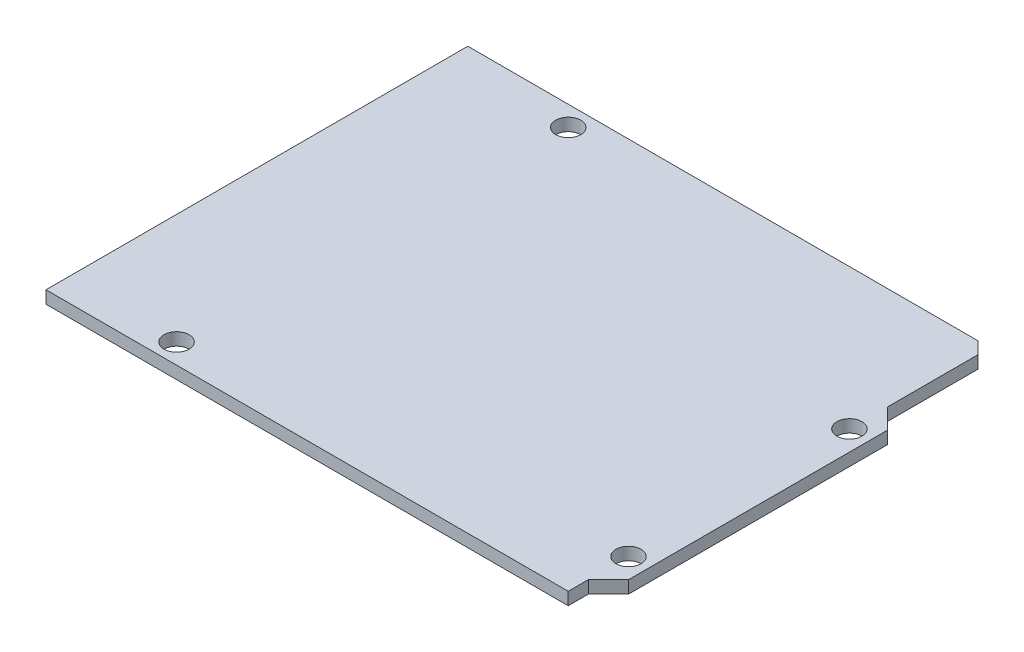
ISO-10303-21;
HEADER;
FILE_DESCRIPTION(('STEP AP214'),'2;1');
FILE_NAME('part.step','',(''),(''),'','','');
FILE_SCHEMA(('AUTOMOTIVE_DESIGN { 1 0 10303 214 1 1 1 1 }'));
ENDSEC;
DATA;
#1=APPLICATION_CONTEXT('core data for automotive mechanical design processes');
#2=APPLICATION_PROTOCOL_DEFINITION('international standard','automotive_design',2000,#1);
#3=PRODUCT_CONTEXT('',#1,'mechanical');
#4=PRODUCT('Part','Part','',(#3));
#5=PRODUCT_RELATED_PRODUCT_CATEGORY('part','',(#4));
#6=PRODUCT_DEFINITION_FORMATION('','',#4);
#7=PRODUCT_DEFINITION_CONTEXT('part definition',#1,'design');
#8=PRODUCT_DEFINITION('design','',#6,#7);
#9=PRODUCT_DEFINITION_SHAPE('','',#8);
#10=(LENGTH_UNIT() NAMED_UNIT(*) SI_UNIT(.MILLI.,.METRE.));
#11=(NAMED_UNIT(*) PLANE_ANGLE_UNIT() SI_UNIT($,.RADIAN.));
#12=(NAMED_UNIT(*) SI_UNIT($,.STERADIAN.) SOLID_ANGLE_UNIT());
#13=UNCERTAINTY_MEASURE_WITH_UNIT(LENGTH_MEASURE(1.E-05),#10,'distance_accuracy_value','');
#14=(GEOMETRIC_REPRESENTATION_CONTEXT(3) GLOBAL_UNCERTAINTY_ASSIGNED_CONTEXT((#13)) GLOBAL_UNIT_ASSIGNED_CONTEXT((#10,
#11,#12)) REPRESENTATION_CONTEXT('',''));
#15=CARTESIAN_POINT('',(0.,0.,0.));
#16=DIRECTION('',(0.,0.,1.));
#17=DIRECTION('',(1.,0.,0.));
#18=AXIS2_PLACEMENT_3D('',#15,#16,#17);
#19=CARTESIAN_POINT('',(66.04,1.5875,0.));
#20=DIRECTION('',(0.,0.,-1.));
#21=DIRECTION('',(-1.,0.,0.));
#22=AXIS2_PLACEMENT_3D('',#19,#20,#21);
#23=PLANE('',#22);
#24=DIRECTION('',(1.,0.,0.));
#25=VECTOR('',#24,1.);
#26=CARTESIAN_POINT('',(66.04,0.,0.));
#27=LINE('',#26,#25);
#28=CARTESIAN_POINT('',(0.,0.,0.));
#29=VERTEX_POINT('',#28);
#30=CARTESIAN_POINT('',(66.04,0.,0.));
#31=VERTEX_POINT('',#30);
#32=EDGE_CURVE('E139',#29,#31,#27,.T.);
#33=ORIENTED_EDGE('',*,*,#32,.T.);
#34=DIRECTION('',(0.,-1.,0.));
#35=VECTOR('',#34,1.);
#36=CARTESIAN_POINT('',(66.04,1.5875,0.));
#37=LINE('',#36,#35);
#38=CARTESIAN_POINT('',(66.04,1.5875,0.));
#39=VERTEX_POINT('',#38);
#40=EDGE_CURVE('E11',#39,#31,#37,.T.);
#41=ORIENTED_EDGE('',*,*,#40,.F.);
#42=DIRECTION('',(1.,0.,0.));
#43=VECTOR('',#42,1.);
#44=CARTESIAN_POINT('',(66.04,1.5875,0.));
#45=LINE('',#44,#43);
#46=CARTESIAN_POINT('',(0.,1.5875,0.));
#47=VERTEX_POINT('',#46);
#48=EDGE_CURVE('E156',#47,#39,#45,.T.);
#49=ORIENTED_EDGE('',*,*,#48,.F.);
#50=DIRECTION('',(0.,-1.,0.));
#51=VECTOR('',#50,1.);
#52=CARTESIAN_POINT('',(0.,1.5875,0.));
#53=LINE('',#52,#51);
#54=EDGE_CURVE('E135',#47,#29,#53,.T.);
#55=ORIENTED_EDGE('',*,*,#54,.T.);
#56=EDGE_LOOP('',(#33,#41,#49,#55));
#57=FACE_BOUND('',#56,.T.);
#58=ADVANCED_FACE('F37',(#57),#23,.F.);
#59=CARTESIAN_POINT('',(66.04,1.5875,-2.54));
#60=DIRECTION('',(-1.,0.,0.));
#61=DIRECTION('',(0.,0.,1.));
#62=AXIS2_PLACEMENT_3D('',#59,#60,#61);
#63=PLANE('',#62);
#64=DIRECTION('',(0.,0.,-1.));
#65=VECTOR('',#64,1.);
#66=CARTESIAN_POINT('',(66.04,0.,-2.54));
#67=LINE('',#66,#65);
#68=CARTESIAN_POINT('',(66.04,0.,-2.54));
#69=VERTEX_POINT('',#68);
#70=EDGE_CURVE('E142',#31,#69,#67,.T.);
#71=ORIENTED_EDGE('',*,*,#70,.T.);
#72=DIRECTION('',(0.,-1.,0.));
#73=VECTOR('',#72,1.);
#74=CARTESIAN_POINT('',(66.04,1.5875,-2.54));
#75=LINE('',#74,#73);
#76=CARTESIAN_POINT('',(66.04,1.5875,-2.54));
#77=VERTEX_POINT('',#76);
#78=EDGE_CURVE('E45',#77,#69,#75,.T.);
#79=ORIENTED_EDGE('',*,*,#78,.F.);
#80=DIRECTION('',(0.,0.,-1.));
#81=VECTOR('',#80,1.);
#82=CARTESIAN_POINT('',(66.04,1.5875,-2.54));
#83=LINE('',#82,#81);
#84=EDGE_CURVE('E99',#39,#77,#83,.T.);
#85=ORIENTED_EDGE('',*,*,#84,.F.);
#86=ORIENTED_EDGE('',*,*,#40,.T.);
#87=EDGE_LOOP('',(#71,#79,#85,#86));
#88=FACE_BOUND('',#87,.T.);
#89=ADVANCED_FACE('F249',(#88),#63,.F.);
#90=CARTESIAN_POINT('',(68.58,1.5875,-5.08));
#91=DIRECTION('',(-0.707106781186547,0.,-0.707106781186548));
#92=DIRECTION('',(-0.707106781186548,0.,0.707106781186547));
#93=AXIS2_PLACEMENT_3D('',#90,#91,#92);
#94=PLANE('',#93);
#95=DIRECTION('',(0.707106781186548,0.,-0.707106781186547));
#96=VECTOR('',#95,1.);
#97=CARTESIAN_POINT('',(68.58,0.,-5.08));
#98=LINE('',#97,#96);
#99=CARTESIAN_POINT('',(68.58,0.,-5.08));
#100=VERTEX_POINT('',#99);
#101=EDGE_CURVE('E145',#69,#100,#98,.T.);
#102=ORIENTED_EDGE('',*,*,#101,.T.);
#103=DIRECTION('',(0.,-1.,0.));
#104=VECTOR('',#103,1.);
#105=CARTESIAN_POINT('',(68.58,1.5875,-5.08));
#106=LINE('',#105,#104);
#107=CARTESIAN_POINT('',(68.58,1.5875,-5.08));
#108=VERTEX_POINT('',#107);
#109=EDGE_CURVE('E166',#108,#100,#106,.T.);
#110=ORIENTED_EDGE('',*,*,#109,.F.);
#111=DIRECTION('',(0.707106781186548,0.,-0.707106781186547));
#112=VECTOR('',#111,1.);
#113=CARTESIAN_POINT('',(68.58,1.5875,-5.08));
#114=LINE('',#113,#112);
#115=EDGE_CURVE('E174',#77,#108,#114,.T.);
#116=ORIENTED_EDGE('',*,*,#115,.F.);
#117=ORIENTED_EDGE('',*,*,#78,.T.);
#118=EDGE_LOOP('',(#102,#110,#116,#117));
#119=FACE_BOUND('',#118,.T.);
#120=ADVANCED_FACE('F172',(#119),#94,.F.);
#121=CARTESIAN_POINT('',(68.58,1.5875,-37.846));
#122=DIRECTION('',(-1.,0.,0.));
#123=DIRECTION('',(0.,0.,1.));
#124=AXIS2_PLACEMENT_3D('',#121,#122,#123);
#125=PLANE('',#124);
#126=DIRECTION('',(0.,0.,-1.));
#127=VECTOR('',#126,1.);
#128=CARTESIAN_POINT('',(68.58,0.,-37.846));
#129=LINE('',#128,#127);
#130=CARTESIAN_POINT('',(68.58,0.,-37.846));
#131=VERTEX_POINT('',#130);
#132=EDGE_CURVE('E147',#100,#131,#129,.T.);
#133=ORIENTED_EDGE('',*,*,#132,.T.);
#134=DIRECTION('',(0.,-1.,0.));
#135=VECTOR('',#134,1.);
#136=CARTESIAN_POINT('',(68.58,1.5875,-37.846));
#137=LINE('',#136,#135);
#138=CARTESIAN_POINT('',(68.58,1.5875,-37.846));
#139=VERTEX_POINT('',#138);
#140=EDGE_CURVE('E163',#139,#131,#137,.T.);
#141=ORIENTED_EDGE('',*,*,#140,.F.);
#142=DIRECTION('',(0.,0.,-1.));
#143=VECTOR('',#142,1.);
#144=CARTESIAN_POINT('',(68.58,1.5875,-37.846));
#145=LINE('',#144,#143);
#146=EDGE_CURVE('E190',#108,#139,#145,.T.);
#147=ORIENTED_EDGE('',*,*,#146,.F.);
#148=ORIENTED_EDGE('',*,*,#109,.T.);
#149=EDGE_LOOP('',(#133,#141,#147,#148));
#150=FACE_BOUND('',#149,.T.);
#151=ADVANCED_FACE('F183',(#150),#125,.F.);
#152=CARTESIAN_POINT('',(66.04,1.5875,-40.386));
#153=DIRECTION('',(-0.707106781186548,0.,0.707106781186548));
#154=DIRECTION('',(0.707106781186548,0.,0.707106781186548));
#155=AXIS2_PLACEMENT_3D('',#152,#153,#154);
#156=PLANE('',#155);
#157=DIRECTION('',(-0.707106781186548,0.,-0.707106781186548));
#158=VECTOR('',#157,1.);
#159=CARTESIAN_POINT('',(66.04,0.,-40.386));
#160=LINE('',#159,#158);
#161=CARTESIAN_POINT('',(66.04,0.,-40.386));
#162=VERTEX_POINT('',#161);
#163=EDGE_CURVE('E149',#131,#162,#160,.T.);
#164=ORIENTED_EDGE('',*,*,#163,.T.);
#165=DIRECTION('',(0.,-1.,0.));
#166=VECTOR('',#165,1.);
#167=CARTESIAN_POINT('',(66.04,1.5875,-40.386));
#168=LINE('',#167,#166);
#169=CARTESIAN_POINT('',(66.04,1.5875,-40.386));
#170=VERTEX_POINT('',#169);
#171=EDGE_CURVE('E160',#170,#162,#168,.T.);
#172=ORIENTED_EDGE('',*,*,#171,.F.);
#173=DIRECTION('',(-0.707106781186548,0.,-0.707106781186548));
#174=VECTOR('',#173,1.);
#175=CARTESIAN_POINT('',(66.04,1.5875,-40.386));
#176=LINE('',#175,#174);
#177=EDGE_CURVE('E189',#139,#170,#176,.T.);
#178=ORIENTED_EDGE('',*,*,#177,.F.);
#179=ORIENTED_EDGE('',*,*,#140,.T.);
#180=EDGE_LOOP('',(#164,#172,#178,#179));
#181=FACE_BOUND('',#180,.T.);
#182=ADVANCED_FACE('F187',(#181),#156,.F.);
#183=CARTESIAN_POINT('',(66.04,1.5875,-51.816));
#184=DIRECTION('',(-1.,0.,0.));
#185=DIRECTION('',(0.,0.,1.));
#186=AXIS2_PLACEMENT_3D('',#183,#184,#185);
#187=PLANE('',#186);
#188=DIRECTION('',(0.,0.,-1.));
#189=VECTOR('',#188,1.);
#190=CARTESIAN_POINT('',(66.04,0.,-51.816));
#191=LINE('',#190,#189);
#192=CARTESIAN_POINT('',(66.04,0.,-51.816));
#193=VERTEX_POINT('',#192);
#194=EDGE_CURVE('E151',#162,#193,#191,.T.);
#195=ORIENTED_EDGE('',*,*,#194,.T.);
#196=DIRECTION('',(0.,-1.,0.));
#197=VECTOR('',#196,1.);
#198=CARTESIAN_POINT('',(66.04,1.5875,-51.816));
#199=LINE('',#198,#197);
#200=CARTESIAN_POINT('',(66.04,1.5875,-51.816));
#201=VERTEX_POINT('',#200);
#202=EDGE_CURVE('E130',#201,#193,#199,.T.);
#203=ORIENTED_EDGE('',*,*,#202,.F.);
#204=DIRECTION('',(0.,0.,-1.));
#205=VECTOR('',#204,1.);
#206=CARTESIAN_POINT('',(66.04,1.5875,-51.816));
#207=LINE('',#206,#205);
#208=EDGE_CURVE('E121',#170,#201,#207,.T.);
#209=ORIENTED_EDGE('',*,*,#208,.F.);
#210=ORIENTED_EDGE('',*,*,#171,.T.);
#211=EDGE_LOOP('',(#195,#203,#209,#210));
#212=FACE_BOUND('',#211,.T.);
#213=ADVANCED_FACE('F257',(#212),#187,.F.);
#214=CARTESIAN_POINT('',(64.516,1.5875,-53.34));
#215=DIRECTION('',(-0.707106781186548,0.,0.707106781186548));
#216=DIRECTION('',(0.707106781186548,0.,0.707106781186548));
#217=AXIS2_PLACEMENT_3D('',#214,#215,#216);
#218=PLANE('',#217);
#219=DIRECTION('',(-0.707106781186548,0.,-0.707106781186548));
#220=VECTOR('',#219,1.);
#221=CARTESIAN_POINT('',(64.516,0.,-53.34));
#222=LINE('',#221,#220);
#223=CARTESIAN_POINT('',(64.516,0.,-53.34));
#224=VERTEX_POINT('',#223);
#225=EDGE_CURVE('E129',#193,#224,#222,.T.);
#226=ORIENTED_EDGE('',*,*,#225,.T.);
#227=DIRECTION('',(0.,-1.,0.));
#228=VECTOR('',#227,1.);
#229=CARTESIAN_POINT('',(64.516,1.5875,-53.34));
#230=LINE('',#229,#228);
#231=CARTESIAN_POINT('',(64.516,1.5875,-53.34));
#232=VERTEX_POINT('',#231);
#233=EDGE_CURVE('E126',#232,#224,#230,.T.);
#234=ORIENTED_EDGE('',*,*,#233,.F.);
#235=DIRECTION('',(-0.707106781186548,0.,-0.707106781186548));
#236=VECTOR('',#235,1.);
#237=CARTESIAN_POINT('',(64.516,1.5875,-53.34));
#238=LINE('',#237,#236);
#239=EDGE_CURVE('E115',#201,#232,#238,.T.);
#240=ORIENTED_EDGE('',*,*,#239,.F.);
#241=ORIENTED_EDGE('',*,*,#202,.T.);
#242=EDGE_LOOP('',(#226,#234,#240,#241));
#243=FACE_BOUND('',#242,.T.);
#244=ADVANCED_FACE('F127',(#243),#218,.F.);
#245=CARTESIAN_POINT('',(0.,1.5875,-53.34));
#246=DIRECTION('',(0.,0.,1.));
#247=DIRECTION('',(1.,0.,0.));
#248=AXIS2_PLACEMENT_3D('',#245,#246,#247);
#249=PLANE('',#248);
#250=DIRECTION('',(-1.,0.,0.));
#251=VECTOR('',#250,1.);
#252=CARTESIAN_POINT('',(0.,0.,-53.34));
#253=LINE('',#252,#251);
#254=CARTESIAN_POINT('',(0.,0.,-53.34));
#255=VERTEX_POINT('',#254);
#256=EDGE_CURVE('E85',#224,#255,#253,.T.);
#257=ORIENTED_EDGE('',*,*,#256,.T.);
#258=DIRECTION('',(0.,-1.,0.));
#259=VECTOR('',#258,1.);
#260=CARTESIAN_POINT('',(0.,1.5875,-53.34));
#261=LINE('',#260,#259);
#262=CARTESIAN_POINT('',(0.,1.5875,-53.34));
#263=VERTEX_POINT('',#262);
#264=EDGE_CURVE('E131',#263,#255,#261,.T.);
#265=ORIENTED_EDGE('',*,*,#264,.F.);
#266=DIRECTION('',(-1.,0.,0.));
#267=VECTOR('',#266,1.);
#268=CARTESIAN_POINT('',(0.,1.5875,-53.34));
#269=LINE('',#268,#267);
#270=EDGE_CURVE('E119',#232,#263,#269,.T.);
#271=ORIENTED_EDGE('',*,*,#270,.F.);
#272=ORIENTED_EDGE('',*,*,#233,.T.);
#273=EDGE_LOOP('',(#257,#265,#271,#272));
#274=FACE_BOUND('',#273,.T.);
#275=ADVANCED_FACE('F133',(#274),#249,.F.);
#276=CARTESIAN_POINT('',(0.,1.5875,0.));
#277=DIRECTION('',(1.,0.,0.));
#278=DIRECTION('',(0.,0.,-1.));
#279=AXIS2_PLACEMENT_3D('',#276,#277,#278);
#280=PLANE('',#279);
#281=DIRECTION('',(0.,0.,1.));
#282=VECTOR('',#281,1.);
#283=CARTESIAN_POINT('',(0.,0.,0.));
#284=LINE('',#283,#282);
#285=EDGE_CURVE('E91',#255,#29,#284,.T.);
#286=ORIENTED_EDGE('',*,*,#285,.T.);
#287=ORIENTED_EDGE('',*,*,#54,.F.);
#288=DIRECTION('',(0.,0.,1.));
#289=VECTOR('',#288,1.);
#290=CARTESIAN_POINT('',(0.,1.5875,0.));
#291=LINE('',#290,#289);
#292=EDGE_CURVE('E53',#263,#47,#291,.T.);
#293=ORIENTED_EDGE('',*,*,#292,.F.);
#294=ORIENTED_EDGE('',*,*,#264,.T.);
#295=EDGE_LOOP('',(#286,#287,#293,#294));
#296=FACE_BOUND('',#295,.T.);
#297=ADVANCED_FACE('F225',(#296),#280,.F.);
#298=CARTESIAN_POINT('',(0.,1.5875,0.));
#299=DIRECTION('',(0.,-1.,0.));
#300=DIRECTION('',(0.,0.,-1.));
#301=AXIS2_PLACEMENT_3D('',#298,#299,#300);
#302=PLANE('',#301);
#303=CARTESIAN_POINT('',(13.97,1.5875,-2.54));
#304=DIRECTION('',(0.,1.,0.));
#305=DIRECTION('',(0.,0.,1.));
#306=AXIS2_PLACEMENT_3D('',#303,#304,#305);
#307=CIRCLE('',#306,1.58749999999999);
#308=CARTESIAN_POINT('',(13.97,1.5875,-0.952500000000012));
#309=VERTEX_POINT('',#308);
#310=EDGE_CURVE('E217',#309,#309,#307,.T.);
#311=ORIENTED_EDGE('',*,*,#310,.F.);
#312=EDGE_LOOP('',(#311));
#313=FACE_BOUND('',#312,.T.);
#314=CARTESIAN_POINT('',(15.24,1.5875,-50.8));
#315=DIRECTION('',(0.,1.,0.));
#316=DIRECTION('',(0.,0.,1.));
#317=AXIS2_PLACEMENT_3D('',#314,#315,#316);
#318=CIRCLE('',#317,1.58749999999999);
#319=CARTESIAN_POINT('',(15.24,1.5875,-49.2125));
#320=VERTEX_POINT('',#319);
#321=EDGE_CURVE('E211',#320,#320,#318,.T.);
#322=ORIENTED_EDGE('',*,*,#321,.F.);
#323=EDGE_LOOP('',(#322));
#324=FACE_BOUND('',#323,.T.);
#325=CARTESIAN_POINT('',(66.04,1.5875,-35.56));
#326=DIRECTION('',(0.,1.,0.));
#327=DIRECTION('',(0.,0.,1.));
#328=AXIS2_PLACEMENT_3D('',#325,#326,#327);
#329=CIRCLE('',#328,1.58749999999999);
#330=CARTESIAN_POINT('',(66.04,1.5875,-33.9725));
#331=VERTEX_POINT('',#330);
#332=EDGE_CURVE('E205',#331,#331,#329,.T.);
#333=ORIENTED_EDGE('',*,*,#332,.F.);
#334=EDGE_LOOP('',(#333));
#335=FACE_BOUND('',#334,.T.);
#336=CARTESIAN_POINT('',(66.04,1.5875,-7.62));
#337=DIRECTION('',(0.,1.,0.));
#338=DIRECTION('',(0.,0.,1.));
#339=AXIS2_PLACEMENT_3D('',#336,#337,#338);
#340=CIRCLE('',#339,1.58749999999999);
#341=CARTESIAN_POINT('',(66.04,1.5875,-6.03250000000001));
#342=VERTEX_POINT('',#341);
#343=EDGE_CURVE('E199',#342,#342,#340,.T.);
#344=ORIENTED_EDGE('',*,*,#343,.F.);
#345=EDGE_LOOP('',(#344));
#346=FACE_BOUND('',#345,.T.);
#347=ORIENTED_EDGE('',*,*,#48,.T.);
#348=ORIENTED_EDGE('',*,*,#84,.T.);
#349=ORIENTED_EDGE('',*,*,#115,.T.);
#350=ORIENTED_EDGE('',*,*,#146,.T.);
#351=ORIENTED_EDGE('',*,*,#177,.T.);
#352=ORIENTED_EDGE('',*,*,#208,.T.);
#353=ORIENTED_EDGE('',*,*,#239,.T.);
#354=ORIENTED_EDGE('',*,*,#270,.T.);
#355=ORIENTED_EDGE('',*,*,#292,.T.);
#356=EDGE_LOOP('',(#347,#348,#349,#350,#351,#352,#353,#354,#355));
#357=FACE_BOUND('',#356,.T.);
#358=ADVANCED_FACE('F117',(#313,#324,#335,#346,#357),#302,.F.);
#359=CARTESIAN_POINT('',(0.,0.,0.));
#360=DIRECTION('',(0.,-1.,0.));
#361=DIRECTION('',(0.,0.,-1.));
#362=AXIS2_PLACEMENT_3D('',#359,#360,#361);
#363=PLANE('',#362);
#364=CARTESIAN_POINT('',(13.97,0.,-2.54));
#365=DIRECTION('',(0.,1.,0.));
#366=DIRECTION('',(0.,0.,1.));
#367=AXIS2_PLACEMENT_3D('',#364,#365,#366);
#368=CIRCLE('',#367,1.5875);
#369=CARTESIAN_POINT('',(13.97,0.,-0.952500000000003));
#370=VERTEX_POINT('',#369);
#371=EDGE_CURVE('E214',#370,#370,#368,.T.);
#372=ORIENTED_EDGE('',*,*,#371,.T.);
#373=EDGE_LOOP('',(#372));
#374=FACE_BOUND('',#373,.T.);
#375=CARTESIAN_POINT('',(15.24,0.,-50.8));
#376=DIRECTION('',(0.,1.,0.));
#377=DIRECTION('',(0.,0.,1.));
#378=AXIS2_PLACEMENT_3D('',#375,#376,#377);
#379=CIRCLE('',#378,1.5875);
#380=CARTESIAN_POINT('',(15.24,0.,-49.2125));
#381=VERTEX_POINT('',#380);
#382=EDGE_CURVE('E208',#381,#381,#379,.T.);
#383=ORIENTED_EDGE('',*,*,#382,.T.);
#384=EDGE_LOOP('',(#383));
#385=FACE_BOUND('',#384,.T.);
#386=CARTESIAN_POINT('',(66.04,0.,-35.56));
#387=DIRECTION('',(0.,1.,0.));
#388=DIRECTION('',(0.,0.,1.));
#389=AXIS2_PLACEMENT_3D('',#386,#387,#388);
#390=CIRCLE('',#389,1.58749999999999);
#391=CARTESIAN_POINT('',(66.04,0.,-33.9725));
#392=VERTEX_POINT('',#391);
#393=EDGE_CURVE('E202',#392,#392,#390,.T.);
#394=ORIENTED_EDGE('',*,*,#393,.T.);
#395=EDGE_LOOP('',(#394));
#396=FACE_BOUND('',#395,.T.);
#397=CARTESIAN_POINT('',(66.04,0.,-7.62));
#398=DIRECTION('',(0.,1.,0.));
#399=DIRECTION('',(0.,0.,1.));
#400=AXIS2_PLACEMENT_3D('',#397,#398,#399);
#401=CIRCLE('',#400,1.58749999999999);
#402=CARTESIAN_POINT('',(66.04,0.,-6.03250000000001));
#403=VERTEX_POINT('',#402);
#404=EDGE_CURVE('E143',#403,#403,#401,.T.);
#405=ORIENTED_EDGE('',*,*,#404,.T.);
#406=EDGE_LOOP('',(#405));
#407=FACE_BOUND('',#406,.T.);
#408=ORIENTED_EDGE('',*,*,#32,.F.);
#409=ORIENTED_EDGE('',*,*,#285,.F.);
#410=ORIENTED_EDGE('',*,*,#256,.F.);
#411=ORIENTED_EDGE('',*,*,#225,.F.);
#412=ORIENTED_EDGE('',*,*,#194,.F.);
#413=ORIENTED_EDGE('',*,*,#163,.F.);
#414=ORIENTED_EDGE('',*,*,#132,.F.);
#415=ORIENTED_EDGE('',*,*,#101,.F.);
#416=ORIENTED_EDGE('',*,*,#70,.F.);
#417=EDGE_LOOP('',(#408,#409,#410,#411,#412,#413,#414,#415,#416));
#418=FACE_BOUND('',#417,.T.);
#419=ADVANCED_FACE('F178',(#374,#385,#396,#407,#418),#363,.T.);
#420=CARTESIAN_POINT('',(66.04,1.5875,-7.62));
#421=DIRECTION('',(0.,1.,0.));
#422=DIRECTION('',(0.,0.,1.));
#423=AXIS2_PLACEMENT_3D('',#420,#421,#422);
#424=CYLINDRICAL_SURFACE('',#423,1.58749999999999);
#425=ORIENTED_EDGE('',*,*,#404,.F.);
#426=EDGE_LOOP('',(#425));
#427=FACE_BOUND('',#426,.T.);
#428=ORIENTED_EDGE('',*,*,#343,.T.);
#429=EDGE_LOOP('',(#428));
#430=FACE_BOUND('',#429,.T.);
#431=ADVANCED_FACE('F233',(#427,#430),#424,.F.);
#432=CARTESIAN_POINT('',(66.04,1.5875,-35.56));
#433=DIRECTION('',(0.,1.,0.));
#434=DIRECTION('',(0.,0.,1.));
#435=AXIS2_PLACEMENT_3D('',#432,#433,#434);
#436=CYLINDRICAL_SURFACE('',#435,1.58749999999999);
#437=ORIENTED_EDGE('',*,*,#393,.F.);
#438=EDGE_LOOP('',(#437));
#439=FACE_BOUND('',#438,.T.);
#440=ORIENTED_EDGE('',*,*,#332,.T.);
#441=EDGE_LOOP('',(#440));
#442=FACE_BOUND('',#441,.T.);
#443=ADVANCED_FACE('F235',(#439,#442),#436,.F.);
#444=CARTESIAN_POINT('',(15.24,1.5875,-50.8));
#445=DIRECTION('',(0.,1.,0.));
#446=DIRECTION('',(0.,0.,1.));
#447=AXIS2_PLACEMENT_3D('',#444,#445,#446);
#448=CYLINDRICAL_SURFACE('',#447,1.58749999999999);
#449=ORIENTED_EDGE('',*,*,#382,.F.);
#450=EDGE_LOOP('',(#449));
#451=FACE_BOUND('',#450,.T.);
#452=ORIENTED_EDGE('',*,*,#321,.T.);
#453=EDGE_LOOP('',(#452));
#454=FACE_BOUND('',#453,.T.);
#455=ADVANCED_FACE('F242',(#451,#454),#448,.F.);
#456=CARTESIAN_POINT('',(13.97,1.5875,-2.54));
#457=DIRECTION('',(0.,1.,0.));
#458=DIRECTION('',(0.,0.,1.));
#459=AXIS2_PLACEMENT_3D('',#456,#457,#458);
#460=CYLINDRICAL_SURFACE('',#459,1.58749999999999);
#461=ORIENTED_EDGE('',*,*,#371,.F.);
#462=EDGE_LOOP('',(#461));
#463=FACE_BOUND('',#462,.T.);
#464=ORIENTED_EDGE('',*,*,#310,.T.);
#465=EDGE_LOOP('',(#464));
#466=FACE_BOUND('',#465,.T.);
#467=ADVANCED_FACE('F221',(#463,#466),#460,.F.);
#468=CLOSED_SHELL('',(#58,#89,#120,#151,#182,#213,#244,#275,#297,#358,#419,#431,#443,#455,#467));
#469=MANIFOLD_SOLID_BREP('B2',#468);
#470=ADVANCED_BREP_SHAPE_REPRESENTATION('',(#18,#469),#14);
#471=SHAPE_DEFINITION_REPRESENTATION(#9,#470);
ENDSEC;
END-ISO-10303-21;
